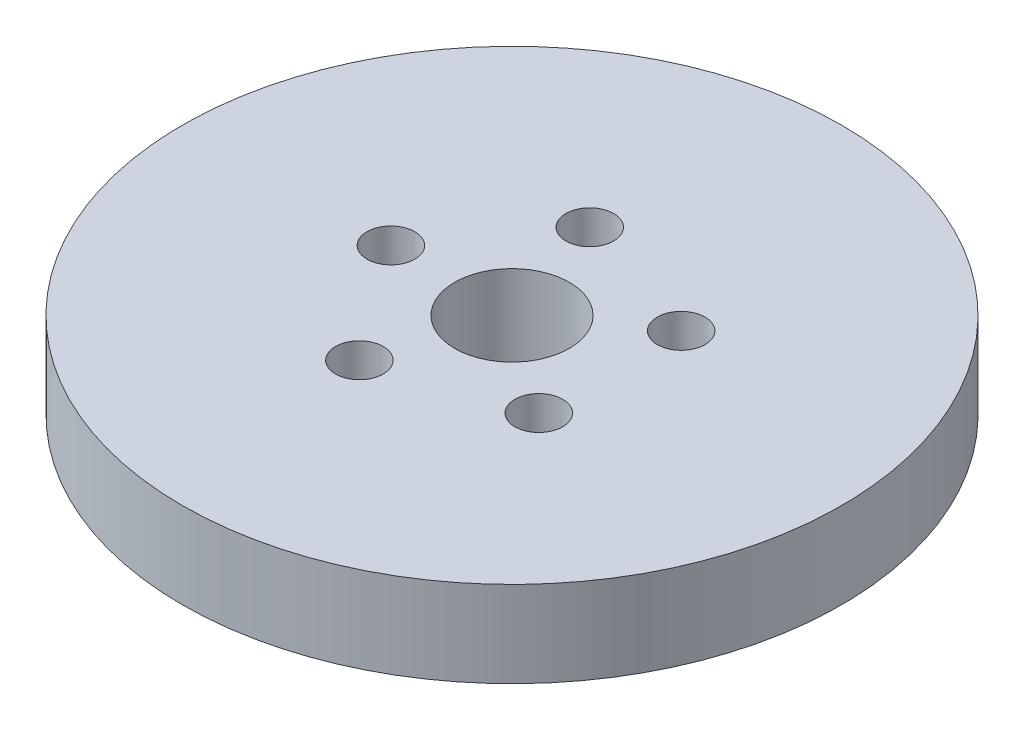
ISO-10303-21;
HEADER;
FILE_DESCRIPTION(('STEP AP214'),'2;1');
FILE_NAME('part.step','',(''),(''),'','','');
FILE_SCHEMA(('AUTOMOTIVE_DESIGN { 1 0 10303 214 1 1 1 1 }'));
ENDSEC;
DATA;
#1=APPLICATION_CONTEXT('core data for automotive mechanical design processes');
#2=APPLICATION_PROTOCOL_DEFINITION('international standard','automotive_design',2000,#1);
#3=PRODUCT_CONTEXT('',#1,'mechanical');
#4=PRODUCT('Part','Part','',(#3));
#5=PRODUCT_RELATED_PRODUCT_CATEGORY('part','',(#4));
#6=PRODUCT_DEFINITION_FORMATION('','',#4);
#7=PRODUCT_DEFINITION_CONTEXT('part definition',#1,'design');
#8=PRODUCT_DEFINITION('design','',#6,#7);
#9=PRODUCT_DEFINITION_SHAPE('','',#8);
#10=(LENGTH_UNIT() NAMED_UNIT(*) SI_UNIT(.MILLI.,.METRE.));
#11=(NAMED_UNIT(*) PLANE_ANGLE_UNIT() SI_UNIT($,.RADIAN.));
#12=(NAMED_UNIT(*) SI_UNIT($,.STERADIAN.) SOLID_ANGLE_UNIT());
#13=UNCERTAINTY_MEASURE_WITH_UNIT(LENGTH_MEASURE(1.E-05),#10,'distance_accuracy_value','');
#14=(GEOMETRIC_REPRESENTATION_CONTEXT(3) GLOBAL_UNCERTAINTY_ASSIGNED_CONTEXT((#13)) GLOBAL_UNIT_ASSIGNED_CONTEXT((#10,
#11,#12)) REPRESENTATION_CONTEXT('',''));
#15=CARTESIAN_POINT('',(0.,0.,0.));
#16=DIRECTION('',(0.,0.,1.));
#17=DIRECTION('',(1.,0.,0.));
#18=AXIS2_PLACEMENT_3D('',#15,#16,#17);
#19=CARTESIAN_POINT('',(0.,15.,0.));
#20=DIRECTION('',(0.,-1.,0.));
#21=DIRECTION('',(0.,0.,-1.));
#22=AXIS2_PLACEMENT_3D('',#19,#20,#21);
#23=CYLINDRICAL_SURFACE('',#22,57.5);
#24=CARTESIAN_POINT('',(0.,15.,0.));
#25=DIRECTION('',(0.,1.,0.));
#26=DIRECTION('',(0.,0.,1.));
#27=AXIS2_PLACEMENT_3D('',#24,#25,#26);
#28=CIRCLE('',#27,57.5);
#29=CARTESIAN_POINT('',(0.,15.,57.5));
#30=VERTEX_POINT('',#29);
#31=EDGE_CURVE('E10',#30,#30,#28,.T.);
#32=ORIENTED_EDGE('',*,*,#31,.F.);
#33=EDGE_LOOP('',(#32));
#34=FACE_BOUND('',#33,.T.);
#35=CARTESIAN_POINT('',(0.,0.,0.));
#36=DIRECTION('',(0.,1.,0.));
#37=DIRECTION('',(0.,0.,1.));
#38=AXIS2_PLACEMENT_3D('',#35,#36,#37);
#39=CIRCLE('',#38,57.5);
#40=CARTESIAN_POINT('',(0.,0.,57.5));
#41=VERTEX_POINT('',#40);
#42=EDGE_CURVE('E37',#41,#41,#39,.T.);
#43=ORIENTED_EDGE('',*,*,#42,.T.);
#44=EDGE_LOOP('',(#43));
#45=FACE_BOUND('',#44,.T.);
#46=ADVANCED_FACE('F40',(#34,#45),#23,.T.);
#47=CARTESIAN_POINT('',(0.,15.,0.));
#48=DIRECTION('',(0.,1.,0.));
#49=DIRECTION('',(0.,0.,1.));
#50=AXIS2_PLACEMENT_3D('',#47,#48,#49);
#51=PLANE('',#50);
#52=CARTESIAN_POINT('',(-6.52983363149585,15.,-20.0967614681473));
#53=DIRECTION('',(0.,1.,0.));
#54=DIRECTION('',(-0.95105651629515,0.,0.309016994374958));
#55=AXIS2_PLACEMENT_3D('',#52,#53,#54);
#56=CIRCLE('',#55,4.16469233859379);
#57=CARTESIAN_POINT('',(-10.49069141848,15.,-18.8098007591786));
#58=VERTEX_POINT('',#57);
#59=EDGE_CURVE('E70',#58,#58,#56,.T.);
#60=ORIENTED_EDGE('',*,*,#59,.F.);
#61=EDGE_LOOP('',(#60));
#62=FACE_BOUND('',#61,.T.);
#63=CARTESIAN_POINT('',(17.0953263881376,15.,-12.4204816511145));
#64=DIRECTION('',(0.,1.,0.));
#65=DIRECTION('',(-0.58778525229248,0.,-0.809016994374942));
#66=AXIS2_PLACEMENT_3D('',#63,#64,#65);
#67=CIRCLE('',#66,4.16469233859379);
#68=CARTESIAN_POINT('',(14.6473816511767,15.,-15.78978852938));
#69=VERTEX_POINT('',#68);
#70=EDGE_CURVE('E71',#69,#69,#67,.T.);
#71=ORIENTED_EDGE('',*,*,#70,.F.);
#72=EDGE_LOOP('',(#71));
#73=FACE_BOUND('',#72,.T.);
#74=CARTESIAN_POINT('',(17.0953263881378,15.,12.4204816511142));
#75=DIRECTION('',(0.,1.,0.));
#76=DIRECTION('',(0.587785252292469,0.,-0.809016994374951));
#77=AXIS2_PLACEMENT_3D('',#74,#75,#76);
#78=CIRCLE('',#77,4.16469233859379);
#79=CARTESIAN_POINT('',(19.5432711250986,15.,9.05117477284868));
#80=VERTEX_POINT('',#79);
#81=EDGE_CURVE('E78',#80,#80,#78,.T.);
#82=ORIENTED_EDGE('',*,*,#81,.F.);
#83=EDGE_LOOP('',(#82));
#84=FACE_BOUND('',#83,.T.);
#85=CARTESIAN_POINT('',(-6.52983363149557,15.,20.0967614681474));
#86=DIRECTION('',(0.,1.,0.));
#87=DIRECTION('',(0.951056516295155,0.,0.309016994374945));
#88=AXIS2_PLACEMENT_3D('',#85,#86,#87);
#89=CIRCLE('',#88,4.16469233859379);
#90=CARTESIAN_POINT('',(-2.56897584451143,15.,21.383722177116));
#91=VERTEX_POINT('',#90);
#92=EDGE_CURVE('E61',#91,#91,#89,.T.);
#93=ORIENTED_EDGE('',*,*,#92,.F.);
#94=EDGE_LOOP('',(#93));
#95=FACE_BOUND('',#94,.T.);
#96=CARTESIAN_POINT('',(-21.1309855132841,15.,0.));
#97=DIRECTION('',(0.,1.,0.));
#98=DIRECTION('',(0.,0.,1.));
#99=AXIS2_PLACEMENT_3D('',#96,#97,#98);
#100=CIRCLE('',#99,4.16469233859379);
#101=CARTESIAN_POINT('',(-21.1309855132841,15.,4.16469233859379));
#102=VERTEX_POINT('',#101);
#103=EDGE_CURVE('E54',#102,#102,#100,.T.);
#104=ORIENTED_EDGE('',*,*,#103,.F.);
#105=EDGE_LOOP('',(#104));
#106=FACE_BOUND('',#105,.T.);
#107=CARTESIAN_POINT('',(0.,15.,0.));
#108=DIRECTION('',(0.,1.,0.));
#109=DIRECTION('',(0.,0.,1.));
#110=AXIS2_PLACEMENT_3D('',#107,#108,#109);
#111=CIRCLE('',#110,10.);
#112=CARTESIAN_POINT('',(0.,15.,10.));
#113=VERTEX_POINT('',#112);
#114=EDGE_CURVE('E50',#113,#113,#111,.T.);
#115=ORIENTED_EDGE('',*,*,#114,.F.);
#116=EDGE_LOOP('',(#115));
#117=FACE_BOUND('',#116,.T.);
#118=ORIENTED_EDGE('',*,*,#31,.T.);
#119=EDGE_LOOP('',(#118));
#120=FACE_BOUND('',#119,.T.);
#121=ADVANCED_FACE('F94',(#62,#73,#84,#95,#106,#117,#120),#51,.T.);
#122=CARTESIAN_POINT('',(0.,0.,0.));
#123=DIRECTION('',(0.,1.,0.));
#124=DIRECTION('',(0.,0.,1.));
#125=AXIS2_PLACEMENT_3D('',#122,#123,#124);
#126=PLANE('',#125);
#127=CARTESIAN_POINT('',(0.,0.,0.));
#128=DIRECTION('',(0.,1.,0.));
#129=DIRECTION('',(0.,0.,1.));
#130=AXIS2_PLACEMENT_3D('',#127,#128,#129);
#131=CIRCLE('',#130,10.);
#132=CARTESIAN_POINT('',(0.,0.,10.));
#133=VERTEX_POINT('',#132);
#134=EDGE_CURVE('E47',#133,#133,#131,.T.);
#135=ORIENTED_EDGE('',*,*,#134,.T.);
#136=EDGE_LOOP('',(#135));
#137=FACE_BOUND('',#136,.T.);
#138=ORIENTED_EDGE('',*,*,#42,.F.);
#139=EDGE_LOOP('',(#138));
#140=FACE_BOUND('',#139,.T.);
#141=ADVANCED_FACE('F100',(#137,#140),#126,.F.);
#142=CARTESIAN_POINT('',(0.,15.,0.));
#143=DIRECTION('',(0.,-1.,0.));
#144=DIRECTION('',(0.,0.,-1.));
#145=AXIS2_PLACEMENT_3D('',#142,#143,#144);
#146=CYLINDRICAL_SURFACE('',#145,10.);
#147=ORIENTED_EDGE('',*,*,#114,.T.);
#148=EDGE_LOOP('',(#147));
#149=FACE_BOUND('',#148,.T.);
#150=ORIENTED_EDGE('',*,*,#134,.F.);
#151=EDGE_LOOP('',(#150));
#152=FACE_BOUND('',#151,.T.);
#153=ADVANCED_FACE('F106',(#149,#152),#146,.F.);
#154=CARTESIAN_POINT('',(-21.1309855132841,5.49784771917203,0.));
#155=DIRECTION('',(0.,1.,0.));
#156=DIRECTION('',(0.,0.,1.));
#157=AXIS2_PLACEMENT_3D('',#154,#155,#156);
#158=CYLINDRICAL_SURFACE('',#157,4.16469233859379);
#159=CARTESIAN_POINT('',(-21.1309855132841,5.49784771917203,0.));
#160=DIRECTION('',(0.,1.,0.));
#161=DIRECTION('',(0.,0.,1.));
#162=AXIS2_PLACEMENT_3D('',#159,#160,#161);
#163=CIRCLE('',#162,4.16469233859379);
#164=CARTESIAN_POINT('',(-21.1309855132841,5.49784771917203,4.16469233859379));
#165=VERTEX_POINT('',#164);
#166=EDGE_CURVE('E55',#165,#165,#163,.T.);
#167=ORIENTED_EDGE('',*,*,#166,.F.);
#168=EDGE_LOOP('',(#167));
#169=FACE_BOUND('',#168,.T.);
#170=ORIENTED_EDGE('',*,*,#103,.T.);
#171=EDGE_LOOP('',(#170));
#172=FACE_BOUND('',#171,.T.);
#173=ADVANCED_FACE('F108',(#169,#172),#158,.F.);
#174=CARTESIAN_POINT('',(-21.1309855132841,5.49784771917203,0.));
#175=DIRECTION('',(0.,1.,0.));
#176=DIRECTION('',(0.,0.,1.));
#177=AXIS2_PLACEMENT_3D('',#174,#175,#176);
#178=PLANE('',#177);
#179=ORIENTED_EDGE('',*,*,#166,.T.);
#180=EDGE_LOOP('',(#179));
#181=FACE_BOUND('',#180,.T.);
#182=ADVANCED_FACE('F138',(#181),#178,.T.);
#183=CARTESIAN_POINT('',(-6.52983363149557,5.49784771917203,20.0967614681474));
#184=DIRECTION('',(0.,1.,0.));
#185=DIRECTION('',(0.,0.,1.));
#186=AXIS2_PLACEMENT_3D('',#183,#184,#185);
#187=CYLINDRICAL_SURFACE('',#186,4.16469233859379);
#188=CARTESIAN_POINT('',(-6.52983363149557,5.49784771917203,20.0967614681474));
#189=DIRECTION('',(0.,1.,0.));
#190=DIRECTION('',(0.951056516295155,0.,0.309016994374945));
#191=AXIS2_PLACEMENT_3D('',#188,#189,#190);
#192=CIRCLE('',#191,4.16469233859379);
#193=CARTESIAN_POINT('',(-2.56897584451143,5.49784771917203,21.383722177116));
#194=VERTEX_POINT('',#193);
#195=EDGE_CURVE('E59',#194,#194,#192,.T.);
#196=ORIENTED_EDGE('',*,*,#195,.F.);
#197=EDGE_LOOP('',(#196));
#198=FACE_BOUND('',#197,.T.);
#199=ORIENTED_EDGE('',*,*,#92,.T.);
#200=EDGE_LOOP('',(#199));
#201=FACE_BOUND('',#200,.T.);
#202=ADVANCED_FACE('F150',(#198,#201),#187,.F.);
#203=CARTESIAN_POINT('',(-6.52983363149557,5.49784771917203,20.0967614681474));
#204=DIRECTION('',(0.,1.,0.));
#205=DIRECTION('',(0.951056516295155,0.,0.309016994374945));
#206=AXIS2_PLACEMENT_3D('',#203,#204,#205);
#207=PLANE('',#206);
#208=ORIENTED_EDGE('',*,*,#195,.T.);
#209=EDGE_LOOP('',(#208));
#210=FACE_BOUND('',#209,.T.);
#211=ADVANCED_FACE('F89',(#210),#207,.T.);
#212=CARTESIAN_POINT('',(17.0953263881378,5.49784771917203,12.4204816511142));
#213=DIRECTION('',(0.,1.,0.));
#214=DIRECTION('',(0.,0.,1.));
#215=AXIS2_PLACEMENT_3D('',#212,#213,#214);
#216=CYLINDRICAL_SURFACE('',#215,4.16469233859379);
#217=CARTESIAN_POINT('',(17.0953263881378,5.49784771917203,12.4204816511142));
#218=DIRECTION('',(0.,1.,0.));
#219=DIRECTION('',(0.587785252292469,0.,-0.809016994374951));
#220=AXIS2_PLACEMENT_3D('',#217,#218,#219);
#221=CIRCLE('',#220,4.16469233859379);
#222=CARTESIAN_POINT('',(19.5432711250986,5.49784771917203,9.05117477284868));
#223=VERTEX_POINT('',#222);
#224=EDGE_CURVE('E63',#223,#223,#221,.T.);
#225=ORIENTED_EDGE('',*,*,#224,.F.);
#226=EDGE_LOOP('',(#225));
#227=FACE_BOUND('',#226,.T.);
#228=ORIENTED_EDGE('',*,*,#81,.T.);
#229=EDGE_LOOP('',(#228));
#230=FACE_BOUND('',#229,.T.);
#231=ADVANCED_FACE('F87',(#227,#230),#216,.F.);
#232=CARTESIAN_POINT('',(17.0953263881378,5.49784771917203,12.4204816511142));
#233=DIRECTION('',(0.,1.,0.));
#234=DIRECTION('',(0.587785252292469,0.,-0.809016994374951));
#235=AXIS2_PLACEMENT_3D('',#232,#233,#234);
#236=PLANE('',#235);
#237=ORIENTED_EDGE('',*,*,#224,.T.);
#238=EDGE_LOOP('',(#237));
#239=FACE_BOUND('',#238,.T.);
#240=ADVANCED_FACE('F84',(#239),#236,.T.);
#241=CARTESIAN_POINT('',(17.0953263881376,5.49784771917203,-12.4204816511145));
#242=DIRECTION('',(0.,1.,0.));
#243=DIRECTION('',(0.,0.,1.));
#244=AXIS2_PLACEMENT_3D('',#241,#242,#243);
#245=CYLINDRICAL_SURFACE('',#244,4.16469233859379);
#246=CARTESIAN_POINT('',(17.0953263881376,5.49784771917203,-12.4204816511145));
#247=DIRECTION('',(0.,1.,0.));
#248=DIRECTION('',(-0.58778525229248,0.,-0.809016994374942));
#249=AXIS2_PLACEMENT_3D('',#246,#247,#248);
#250=CIRCLE('',#249,4.16469233859379);
#251=CARTESIAN_POINT('',(14.6473816511767,5.49784771917203,-15.78978852938));
#252=VERTEX_POINT('',#251);
#253=EDGE_CURVE('E76',#252,#252,#250,.T.);
#254=ORIENTED_EDGE('',*,*,#253,.F.);
#255=EDGE_LOOP('',(#254));
#256=FACE_BOUND('',#255,.T.);
#257=ORIENTED_EDGE('',*,*,#70,.T.);
#258=EDGE_LOOP('',(#257));
#259=FACE_BOUND('',#258,.T.);
#260=ADVANCED_FACE('F185',(#256,#259),#245,.F.);
#261=CARTESIAN_POINT('',(17.0953263881376,5.49784771917203,-12.4204816511145));
#262=DIRECTION('',(0.,1.,0.));
#263=DIRECTION('',(-0.58778525229248,0.,-0.809016994374942));
#264=AXIS2_PLACEMENT_3D('',#261,#262,#263);
#265=PLANE('',#264);
#266=ORIENTED_EDGE('',*,*,#253,.T.);
#267=EDGE_LOOP('',(#266));
#268=FACE_BOUND('',#267,.T.);
#269=ADVANCED_FACE('F189',(#268),#265,.T.);
#270=CARTESIAN_POINT('',(-6.52983363149585,5.49784771917203,-20.0967614681473));
#271=DIRECTION('',(0.,1.,0.));
#272=DIRECTION('',(0.,0.,1.));
#273=AXIS2_PLACEMENT_3D('',#270,#271,#272);
#274=CYLINDRICAL_SURFACE('',#273,4.16469233859379);
#275=CARTESIAN_POINT('',(-6.52983363149585,5.49784771917203,-20.0967614681473));
#276=DIRECTION('',(0.,1.,0.));
#277=DIRECTION('',(-0.95105651629515,0.,0.309016994374958));
#278=AXIS2_PLACEMENT_3D('',#275,#276,#277);
#279=CIRCLE('',#278,4.16469233859379);
#280=CARTESIAN_POINT('',(-10.49069141848,5.49784771917203,-18.8098007591786));
#281=VERTEX_POINT('',#280);
#282=EDGE_CURVE('E69',#281,#281,#279,.T.);
#283=ORIENTED_EDGE('',*,*,#282,.F.);
#284=EDGE_LOOP('',(#283));
#285=FACE_BOUND('',#284,.T.);
#286=ORIENTED_EDGE('',*,*,#59,.T.);
#287=EDGE_LOOP('',(#286));
#288=FACE_BOUND('',#287,.T.);
#289=ADVANCED_FACE('F200',(#285,#288),#274,.F.);
#290=CARTESIAN_POINT('',(-6.52983363149585,5.49784771917203,-20.0967614681473));
#291=DIRECTION('',(0.,1.,0.));
#292=DIRECTION('',(-0.95105651629515,0.,0.309016994374958));
#293=AXIS2_PLACEMENT_3D('',#290,#291,#292);
#294=PLANE('',#293);
#295=ORIENTED_EDGE('',*,*,#282,.T.);
#296=EDGE_LOOP('',(#295));
#297=FACE_BOUND('',#296,.T.);
#298=ADVANCED_FACE('F208',(#297),#294,.T.);
#299=CLOSED_SHELL('',(#46,#121,#141,#153,#173,#182,#202,#211,#231,#240,#260,#269,#289,#298));
#300=MANIFOLD_SOLID_BREP('B2',#299);
#301=ADVANCED_BREP_SHAPE_REPRESENTATION('',(#18,#300),#14);
#302=SHAPE_DEFINITION_REPRESENTATION(#9,#301);
ENDSEC;
END-ISO-10303-21;
